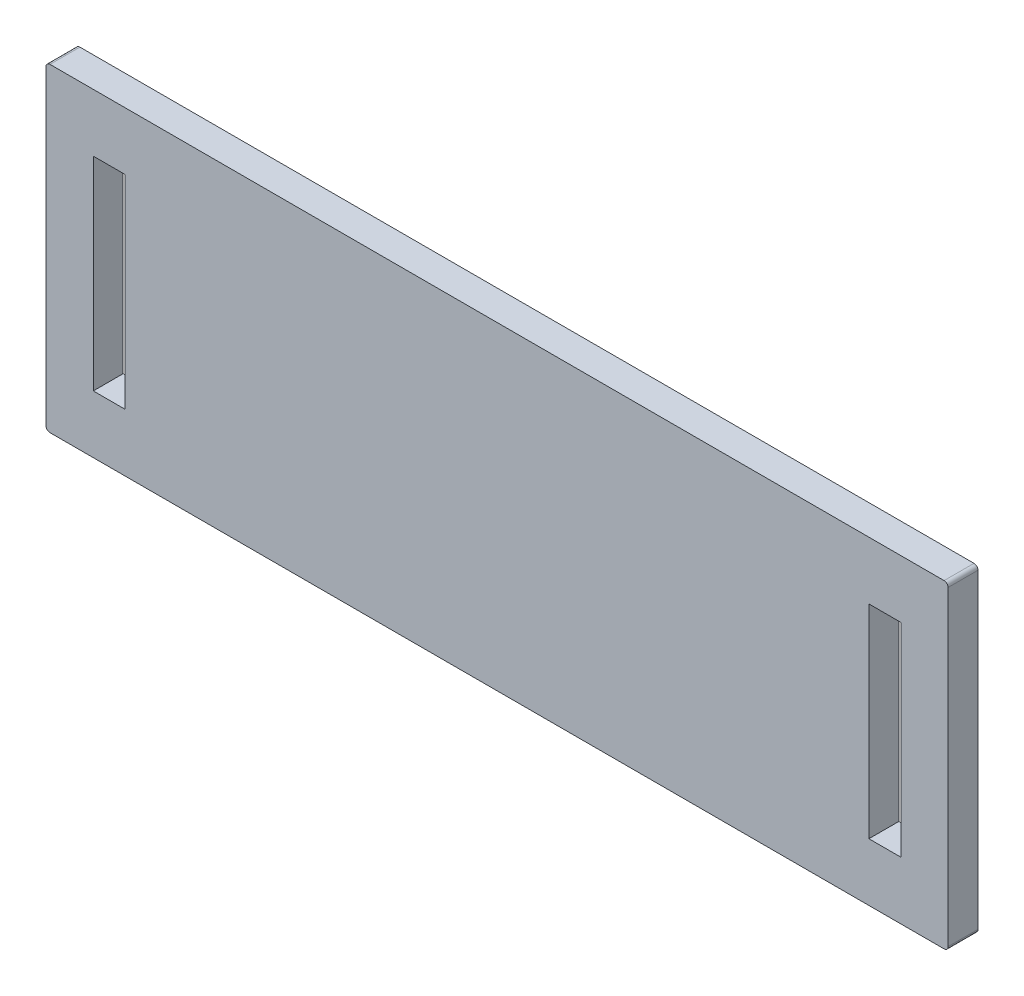
ISO-10303-21;
HEADER;
FILE_DESCRIPTION(('STEP AP214'),'2;1');
FILE_NAME('part.step','',(''),(''),'','','');
FILE_SCHEMA(('AUTOMOTIVE_DESIGN { 1 0 10303 214 1 1 1 1 }'));
ENDSEC;
DATA;
#1=APPLICATION_CONTEXT('core data for automotive mechanical design processes');
#2=APPLICATION_PROTOCOL_DEFINITION('international standard','automotive_design',2000,#1);
#3=PRODUCT_CONTEXT('',#1,'mechanical');
#4=PRODUCT('Part','Part','',(#3));
#5=PRODUCT_RELATED_PRODUCT_CATEGORY('part','',(#4));
#6=PRODUCT_DEFINITION_FORMATION('','',#4);
#7=PRODUCT_DEFINITION_CONTEXT('part definition',#1,'design');
#8=PRODUCT_DEFINITION('design','',#6,#7);
#9=PRODUCT_DEFINITION_SHAPE('','',#8);
#10=(LENGTH_UNIT() NAMED_UNIT(*) SI_UNIT(.MILLI.,.METRE.));
#11=(NAMED_UNIT(*) PLANE_ANGLE_UNIT() SI_UNIT($,.RADIAN.));
#12=(NAMED_UNIT(*) SI_UNIT($,.STERADIAN.) SOLID_ANGLE_UNIT());
#13=UNCERTAINTY_MEASURE_WITH_UNIT(LENGTH_MEASURE(1.E-05),#10,'distance_accuracy_value','');
#14=(GEOMETRIC_REPRESENTATION_CONTEXT(3) GLOBAL_UNCERTAINTY_ASSIGNED_CONTEXT((#13)) GLOBAL_UNIT_ASSIGNED_CONTEXT((#10,
#11,#12)) REPRESENTATION_CONTEXT('',''));
#15=CARTESIAN_POINT('',(0.,0.,0.));
#16=DIRECTION('',(0.,0.,1.));
#17=DIRECTION('',(1.,0.,0.));
#18=AXIS2_PLACEMENT_3D('',#15,#16,#17);
#19=CARTESIAN_POINT('',(45.05,15.8,-1.5));
#20=DIRECTION('',(0.,0.,1.));
#21=DIRECTION('',(1.,0.,0.));
#22=AXIS2_PLACEMENT_3D('',#19,#20,#21);
#23=CYLINDRICAL_SURFACE('',#22,0.199999999999997);
#24=CARTESIAN_POINT('',(45.05,15.8,0.));
#25=DIRECTION('',(0.,0.,1.));
#26=DIRECTION('',(-1.,0.,0.));
#27=AXIS2_PLACEMENT_3D('',#24,#25,#26);
#28=CIRCLE('',#27,0.199999999999997);
#29=CARTESIAN_POINT('',(45.25,15.8,0.));
#30=VERTEX_POINT('',#29);
#31=CARTESIAN_POINT('',(45.05,16.,0.));
#32=VERTEX_POINT('',#31);
#33=EDGE_CURVE('E256',#30,#32,#28,.T.);
#34=ORIENTED_EDGE('',*,*,#33,.F.);
#35=DIRECTION('',(0.,0.,1.));
#36=VECTOR('',#35,1.);
#37=CARTESIAN_POINT('',(45.25,15.8,-1.5));
#38=LINE('',#37,#36);
#39=CARTESIAN_POINT('',(45.25,15.8,-1.5));
#40=VERTEX_POINT('',#39);
#41=EDGE_CURVE('E12',#40,#30,#38,.T.);
#42=ORIENTED_EDGE('',*,*,#41,.F.);
#43=CARTESIAN_POINT('',(45.05,15.8,-1.5));
#44=DIRECTION('',(0.,0.,1.));
#45=DIRECTION('',(-1.,0.,0.));
#46=AXIS2_PLACEMENT_3D('',#43,#44,#45);
#47=CIRCLE('',#46,0.199999999999997);
#48=CARTESIAN_POINT('',(45.05,16.,-1.5));
#49=VERTEX_POINT('',#48);
#50=EDGE_CURVE('E266',#40,#49,#47,.T.);
#51=ORIENTED_EDGE('',*,*,#50,.T.);
#52=DIRECTION('',(0.,0.,1.));
#53=VECTOR('',#52,1.);
#54=CARTESIAN_POINT('',(45.05,16.,-1.5));
#55=LINE('',#54,#53);
#56=EDGE_CURVE('E46',#49,#32,#55,.T.);
#57=ORIENTED_EDGE('',*,*,#56,.T.);
#58=EDGE_LOOP('',(#34,#42,#51,#57));
#59=FACE_BOUND('',#58,.T.);
#60=ADVANCED_FACE('F43',(#59),#23,.T.);
#61=CARTESIAN_POINT('',(45.25,0.199999999999999,-1.5));
#62=DIRECTION('',(1.,0.,0.));
#63=DIRECTION('',(0.,0.,-1.));
#64=AXIS2_PLACEMENT_3D('',#61,#62,#63);
#65=PLANE('',#64);
#66=DIRECTION('',(0.,1.,0.));
#67=VECTOR('',#66,1.);
#68=CARTESIAN_POINT('',(45.25,0.199999999999999,0.));
#69=LINE('',#68,#67);
#70=CARTESIAN_POINT('',(45.25,0.199999999999999,0.));
#71=VERTEX_POINT('',#70);
#72=EDGE_CURVE('E271',#71,#30,#69,.T.);
#73=ORIENTED_EDGE('',*,*,#72,.F.);
#74=DIRECTION('',(0.,0.,1.));
#75=VECTOR('',#74,1.);
#76=CARTESIAN_POINT('',(45.25,0.199999999999999,-1.5));
#77=LINE('',#76,#75);
#78=CARTESIAN_POINT('',(45.25,0.199999999999999,-1.5));
#79=VERTEX_POINT('',#78);
#80=EDGE_CURVE('E52',#79,#71,#77,.T.);
#81=ORIENTED_EDGE('',*,*,#80,.F.);
#82=DIRECTION('',(0.,1.,0.));
#83=VECTOR('',#82,1.);
#84=CARTESIAN_POINT('',(45.25,0.199999999999999,-1.5));
#85=LINE('',#84,#83);
#86=EDGE_CURVE('E279',#79,#40,#85,.T.);
#87=ORIENTED_EDGE('',*,*,#86,.T.);
#88=ORIENTED_EDGE('',*,*,#41,.T.);
#89=EDGE_LOOP('',(#73,#81,#87,#88));
#90=FACE_BOUND('',#89,.T.);
#91=ADVANCED_FACE('F347',(#90),#65,.T.);
#92=CARTESIAN_POINT('',(45.05,0.199999999999999,-1.5));
#93=DIRECTION('',(0.,0.,1.));
#94=DIRECTION('',(1.,0.,0.));
#95=AXIS2_PLACEMENT_3D('',#92,#93,#94);
#96=CYLINDRICAL_SURFACE('',#95,0.199999999999997);
#97=CARTESIAN_POINT('',(45.05,0.199999999999999,0.));
#98=DIRECTION('',(0.,0.,1.));
#99=DIRECTION('',(1.,0.,0.));
#100=AXIS2_PLACEMENT_3D('',#97,#98,#99);
#101=CIRCLE('',#100,0.199999999999997);
#102=CARTESIAN_POINT('',(45.05,0.,0.));
#103=VERTEX_POINT('',#102);
#104=EDGE_CURVE('E309',#103,#71,#101,.T.);
#105=ORIENTED_EDGE('',*,*,#104,.F.);
#106=DIRECTION('',(0.,0.,1.));
#107=VECTOR('',#106,1.);
#108=CARTESIAN_POINT('',(45.05,0.,-1.5));
#109=LINE('',#108,#107);
#110=CARTESIAN_POINT('',(45.05,0.,-1.5));
#111=VERTEX_POINT('',#110);
#112=EDGE_CURVE('E318',#111,#103,#109,.T.);
#113=ORIENTED_EDGE('',*,*,#112,.F.);
#114=CARTESIAN_POINT('',(45.05,0.199999999999999,-1.5));
#115=DIRECTION('',(0.,0.,1.));
#116=DIRECTION('',(1.,0.,0.));
#117=AXIS2_PLACEMENT_3D('',#114,#115,#116);
#118=CIRCLE('',#117,0.199999999999997);
#119=EDGE_CURVE('E284',#111,#79,#118,.T.);
#120=ORIENTED_EDGE('',*,*,#119,.T.);
#121=ORIENTED_EDGE('',*,*,#80,.T.);
#122=EDGE_LOOP('',(#105,#113,#120,#121));
#123=FACE_BOUND('',#122,.T.);
#124=ADVANCED_FACE('F379',(#123),#96,.T.);
#125=CARTESIAN_POINT('',(0.200000000000001,0.,-1.5));
#126=DIRECTION('',(0.,-1.,0.));
#127=DIRECTION('',(1.,0.,0.));
#128=AXIS2_PLACEMENT_3D('',#125,#126,#127);
#129=PLANE('',#128);
#130=DIRECTION('',(1.,0.,0.));
#131=VECTOR('',#130,1.);
#132=CARTESIAN_POINT('',(0.200000000000001,0.,0.));
#133=LINE('',#132,#131);
#134=CARTESIAN_POINT('',(0.200000000000001,0.,0.));
#135=VERTEX_POINT('',#134);
#136=EDGE_CURVE('E305',#135,#103,#133,.T.);
#137=ORIENTED_EDGE('',*,*,#136,.F.);
#138=DIRECTION('',(0.,0.,1.));
#139=VECTOR('',#138,1.);
#140=CARTESIAN_POINT('',(0.200000000000001,0.,-1.5));
#141=LINE('',#140,#139);
#142=CARTESIAN_POINT('',(0.200000000000001,0.,-1.5));
#143=VERTEX_POINT('',#142);
#144=EDGE_CURVE('E321',#143,#135,#141,.T.);
#145=ORIENTED_EDGE('',*,*,#144,.F.);
#146=DIRECTION('',(1.,0.,0.));
#147=VECTOR('',#146,1.);
#148=CARTESIAN_POINT('',(0.200000000000001,0.,-1.5));
#149=LINE('',#148,#147);
#150=EDGE_CURVE('E371',#143,#111,#149,.T.);
#151=ORIENTED_EDGE('',*,*,#150,.T.);
#152=ORIENTED_EDGE('',*,*,#112,.T.);
#153=EDGE_LOOP('',(#137,#145,#151,#152));
#154=FACE_BOUND('',#153,.T.);
#155=ADVANCED_FACE('F389',(#154),#129,.T.);
#156=CARTESIAN_POINT('',(0.2,0.2,-1.5));
#157=DIRECTION('',(0.,0.,1.));
#158=DIRECTION('',(1.,0.,0.));
#159=AXIS2_PLACEMENT_3D('',#156,#157,#158);
#160=CYLINDRICAL_SURFACE('',#159,0.2);
#161=CARTESIAN_POINT('',(0.2,0.2,0.));
#162=DIRECTION('',(0.,0.,1.));
#163=DIRECTION('',(-1.,0.,0.));
#164=AXIS2_PLACEMENT_3D('',#161,#162,#163);
#165=CIRCLE('',#164,0.2);
#166=CARTESIAN_POINT('',(0.,0.200000000000001,0.));
#167=VERTEX_POINT('',#166);
#168=EDGE_CURVE('E301',#167,#135,#165,.T.);
#169=ORIENTED_EDGE('',*,*,#168,.F.);
#170=DIRECTION('',(0.,0.,1.));
#171=VECTOR('',#170,1.);
#172=CARTESIAN_POINT('',(0.,0.200000000000001,-1.5));
#173=LINE('',#172,#171);
#174=CARTESIAN_POINT('',(0.,0.200000000000001,-1.5));
#175=VERTEX_POINT('',#174);
#176=EDGE_CURVE('E324',#175,#167,#173,.T.);
#177=ORIENTED_EDGE('',*,*,#176,.F.);
#178=CARTESIAN_POINT('',(0.2,0.2,-1.5));
#179=DIRECTION('',(0.,0.,1.));
#180=DIRECTION('',(-1.,0.,0.));
#181=AXIS2_PLACEMENT_3D('',#178,#179,#180);
#182=CIRCLE('',#181,0.2);
#183=EDGE_CURVE('E361',#175,#143,#182,.T.);
#184=ORIENTED_EDGE('',*,*,#183,.T.);
#185=ORIENTED_EDGE('',*,*,#144,.T.);
#186=EDGE_LOOP('',(#169,#177,#184,#185));
#187=FACE_BOUND('',#186,.T.);
#188=ADVANCED_FACE('F383',(#187),#160,.T.);
#189=CARTESIAN_POINT('',(0.,0.200000000000001,-1.5));
#190=DIRECTION('',(-1.,0.,0.));
#191=DIRECTION('',(0.,-1.,0.));
#192=AXIS2_PLACEMENT_3D('',#189,#190,#191);
#193=PLANE('',#192);
#194=DIRECTION('',(0.,-1.,0.));
#195=VECTOR('',#194,1.);
#196=CARTESIAN_POINT('',(0.,0.200000000000001,0.));
#197=LINE('',#196,#195);
#198=CARTESIAN_POINT('',(0.,15.8,0.));
#199=VERTEX_POINT('',#198);
#200=EDGE_CURVE('E297',#199,#167,#197,.T.);
#201=ORIENTED_EDGE('',*,*,#200,.F.);
#202=DIRECTION('',(0.,0.,1.));
#203=VECTOR('',#202,1.);
#204=CARTESIAN_POINT('',(0.,15.8,-1.5));
#205=LINE('',#204,#203);
#206=CARTESIAN_POINT('',(0.,15.8,-1.5));
#207=VERTEX_POINT('',#206);
#208=EDGE_CURVE('E327',#207,#199,#205,.T.);
#209=ORIENTED_EDGE('',*,*,#208,.F.);
#210=DIRECTION('',(0.,-1.,0.));
#211=VECTOR('',#210,1.);
#212=CARTESIAN_POINT('',(0.,0.200000000000001,-1.5));
#213=LINE('',#212,#211);
#214=EDGE_CURVE('E357',#207,#175,#213,.T.);
#215=ORIENTED_EDGE('',*,*,#214,.T.);
#216=ORIENTED_EDGE('',*,*,#176,.T.);
#217=EDGE_LOOP('',(#201,#209,#215,#216));
#218=FACE_BOUND('',#217,.T.);
#219=ADVANCED_FACE('F387',(#218),#193,.T.);
#220=CARTESIAN_POINT('',(0.199999999999999,15.8,-1.5));
#221=DIRECTION('',(0.,0.,1.));
#222=DIRECTION('',(1.,0.,0.));
#223=AXIS2_PLACEMENT_3D('',#220,#221,#222);
#224=CYLINDRICAL_SURFACE('',#223,0.200000000000001);
#225=CARTESIAN_POINT('',(0.199999999999999,15.8,0.));
#226=DIRECTION('',(0.,0.,1.));
#227=DIRECTION('',(-1.,0.,0.));
#228=AXIS2_PLACEMENT_3D('',#225,#226,#227);
#229=CIRCLE('',#228,0.200000000000001);
#230=CARTESIAN_POINT('',(0.199999999999999,16.,0.));
#231=VERTEX_POINT('',#230);
#232=EDGE_CURVE('E293',#231,#199,#229,.T.);
#233=ORIENTED_EDGE('',*,*,#232,.F.);
#234=DIRECTION('',(0.,0.,1.));
#235=VECTOR('',#234,1.);
#236=CARTESIAN_POINT('',(0.199999999999999,16.,-1.5));
#237=LINE('',#236,#235);
#238=CARTESIAN_POINT('',(0.199999999999999,16.,-1.5));
#239=VERTEX_POINT('',#238);
#240=EDGE_CURVE('E329',#239,#231,#237,.T.);
#241=ORIENTED_EDGE('',*,*,#240,.F.);
#242=CARTESIAN_POINT('',(0.199999999999999,15.8,-1.5));
#243=DIRECTION('',(0.,0.,1.));
#244=DIRECTION('',(-1.,0.,0.));
#245=AXIS2_PLACEMENT_3D('',#242,#243,#244);
#246=CIRCLE('',#245,0.200000000000001);
#247=EDGE_CURVE('E355',#239,#207,#246,.T.);
#248=ORIENTED_EDGE('',*,*,#247,.T.);
#249=ORIENTED_EDGE('',*,*,#208,.T.);
#250=EDGE_LOOP('',(#233,#241,#248,#249));
#251=FACE_BOUND('',#250,.T.);
#252=ADVANCED_FACE('F388',(#251),#224,.T.);
#253=CARTESIAN_POINT('',(0.199999999999999,16.,-1.5));
#254=DIRECTION('',(0.,1.,0.));
#255=DIRECTION('',(-1.,0.,0.));
#256=AXIS2_PLACEMENT_3D('',#253,#254,#255);
#257=PLANE('',#256);
#258=DIRECTION('',(-1.,0.,0.));
#259=VECTOR('',#258,1.);
#260=CARTESIAN_POINT('',(0.199999999999999,16.,0.));
#261=LINE('',#260,#259);
#262=EDGE_CURVE('E290',#32,#231,#261,.T.);
#263=ORIENTED_EDGE('',*,*,#262,.F.);
#264=ORIENTED_EDGE('',*,*,#56,.F.);
#265=DIRECTION('',(-1.,0.,0.));
#266=VECTOR('',#265,1.);
#267=CARTESIAN_POINT('',(0.199999999999999,16.,-1.5));
#268=LINE('',#267,#266);
#269=EDGE_CURVE('E270',#49,#239,#268,.T.);
#270=ORIENTED_EDGE('',*,*,#269,.T.);
#271=ORIENTED_EDGE('',*,*,#240,.T.);
#272=EDGE_LOOP('',(#263,#264,#270,#271));
#273=FACE_BOUND('',#272,.T.);
#274=ADVANCED_FACE('F341',(#273),#257,.T.);
#275=CARTESIAN_POINT('',(45.05,15.8,-1.5));
#276=DIRECTION('',(0.,0.,-1.));
#277=DIRECTION('',(-1.,0.,0.));
#278=AXIS2_PLACEMENT_3D('',#275,#276,#277);
#279=PLANE('',#278);
#280=DIRECTION('',(-1.,0.,0.));
#281=VECTOR('',#280,1.);
#282=CARTESIAN_POINT('',(42.8779069767442,13.1,-1.5));
#283=LINE('',#282,#281);
#284=CARTESIAN_POINT('',(42.8779069767442,13.1,-1.5));
#285=VERTEX_POINT('',#284);
#286=CARTESIAN_POINT('',(41.2779069767442,13.1,-1.5));
#287=VERTEX_POINT('',#286);
#288=EDGE_CURVE('E159',#285,#287,#283,.T.);
#289=ORIENTED_EDGE('',*,*,#288,.T.);
#290=DIRECTION('',(0.,-1.,0.));
#291=VECTOR('',#290,1.);
#292=CARTESIAN_POINT('',(41.2779069767442,13.1,-1.5));
#293=LINE('',#292,#291);
#294=CARTESIAN_POINT('',(41.2779069767442,2.9,-1.5));
#295=VERTEX_POINT('',#294);
#296=EDGE_CURVE('E169',#287,#295,#293,.T.);
#297=ORIENTED_EDGE('',*,*,#296,.T.);
#298=DIRECTION('',(1.,0.,0.));
#299=VECTOR('',#298,1.);
#300=CARTESIAN_POINT('',(42.8779069767442,2.9,-1.5));
#301=LINE('',#300,#299);
#302=CARTESIAN_POINT('',(42.8779069767442,2.9,-1.5));
#303=VERTEX_POINT('',#302);
#304=EDGE_CURVE('E60',#295,#303,#301,.T.);
#305=ORIENTED_EDGE('',*,*,#304,.T.);
#306=DIRECTION('',(0.,1.,0.));
#307=VECTOR('',#306,1.);
#308=CARTESIAN_POINT('',(42.8779069767442,13.1,-1.5));
#309=LINE('',#308,#307);
#310=EDGE_CURVE('E166',#303,#285,#309,.T.);
#311=ORIENTED_EDGE('',*,*,#310,.T.);
#312=EDGE_LOOP('',(#289,#297,#305,#311));
#313=FACE_BOUND('',#312,.T.);
#314=DIRECTION('',(0.,-1.,0.));
#315=VECTOR('',#314,1.);
#316=CARTESIAN_POINT('',(2.37209302325581,13.1,-1.5));
#317=LINE('',#316,#315);
#318=CARTESIAN_POINT('',(2.37209302325581,13.1,-1.5));
#319=VERTEX_POINT('',#318);
#320=CARTESIAN_POINT('',(2.37209302325581,2.9,-1.5));
#321=VERTEX_POINT('',#320);
#322=EDGE_CURVE('E216',#319,#321,#317,.T.);
#323=ORIENTED_EDGE('',*,*,#322,.T.);
#324=DIRECTION('',(1.,0.,0.));
#325=VECTOR('',#324,1.);
#326=CARTESIAN_POINT('',(2.37209302325581,2.9,-1.5));
#327=LINE('',#326,#325);
#328=CARTESIAN_POINT('',(3.9720930232558,2.9,-1.5));
#329=VERTEX_POINT('',#328);
#330=EDGE_CURVE('E221',#321,#329,#327,.T.);
#331=ORIENTED_EDGE('',*,*,#330,.T.);
#332=DIRECTION('',(0.,1.,0.));
#333=VECTOR('',#332,1.);
#334=CARTESIAN_POINT('',(3.97209302325581,13.1,-1.5));
#335=LINE('',#334,#333);
#336=CARTESIAN_POINT('',(3.97209302325581,13.1,-1.5));
#337=VERTEX_POINT('',#336);
#338=EDGE_CURVE('E230',#329,#337,#335,.T.);
#339=ORIENTED_EDGE('',*,*,#338,.T.);
#340=DIRECTION('',(-1.,0.,0.));
#341=VECTOR('',#340,1.);
#342=CARTESIAN_POINT('',(2.37209302325581,13.1,-1.5));
#343=LINE('',#342,#341);
#344=EDGE_CURVE('E234',#337,#319,#343,.T.);
#345=ORIENTED_EDGE('',*,*,#344,.T.);
#346=EDGE_LOOP('',(#323,#331,#339,#345));
#347=FACE_BOUND('',#346,.T.);
#348=ORIENTED_EDGE('',*,*,#50,.F.);
#349=ORIENTED_EDGE('',*,*,#86,.F.);
#350=ORIENTED_EDGE('',*,*,#119,.F.);
#351=ORIENTED_EDGE('',*,*,#150,.F.);
#352=ORIENTED_EDGE('',*,*,#183,.F.);
#353=ORIENTED_EDGE('',*,*,#214,.F.);
#354=ORIENTED_EDGE('',*,*,#247,.F.);
#355=ORIENTED_EDGE('',*,*,#269,.F.);
#356=EDGE_LOOP('',(#348,#349,#350,#351,#352,#353,#354,#355));
#357=FACE_BOUND('',#356,.T.);
#358=ADVANCED_FACE('F174',(#313,#347,#357),#279,.T.);
#359=CARTESIAN_POINT('',(45.05,15.8,0.));
#360=DIRECTION('',(0.,0.,-1.));
#361=DIRECTION('',(-1.,0.,0.));
#362=AXIS2_PLACEMENT_3D('',#359,#360,#361);
#363=PLANE('',#362);
#364=DIRECTION('',(0.,-1.,0.));
#365=VECTOR('',#364,1.);
#366=CARTESIAN_POINT('',(41.2779069767442,13.1,0.));
#367=LINE('',#366,#365);
#368=CARTESIAN_POINT('',(41.2779069767442,13.1,0.));
#369=VERTEX_POINT('',#368);
#370=CARTESIAN_POINT('',(41.2779069767442,2.9,0.));
#371=VERTEX_POINT('',#370);
#372=EDGE_CURVE('E201',#369,#371,#367,.T.);
#373=ORIENTED_EDGE('',*,*,#372,.F.);
#374=DIRECTION('',(-1.,0.,0.));
#375=VECTOR('',#374,1.);
#376=CARTESIAN_POINT('',(42.8779069767442,13.1,0.));
#377=LINE('',#376,#375);
#378=CARTESIAN_POINT('',(42.8779069767442,13.1,0.));
#379=VERTEX_POINT('',#378);
#380=EDGE_CURVE('E68',#379,#369,#377,.T.);
#381=ORIENTED_EDGE('',*,*,#380,.F.);
#382=DIRECTION('',(0.,1.,0.));
#383=VECTOR('',#382,1.);
#384=CARTESIAN_POINT('',(42.8779069767442,13.1,0.));
#385=LINE('',#384,#383);
#386=CARTESIAN_POINT('',(42.8779069767442,2.9,0.));
#387=VERTEX_POINT('',#386);
#388=EDGE_CURVE('E178',#387,#379,#385,.T.);
#389=ORIENTED_EDGE('',*,*,#388,.F.);
#390=DIRECTION('',(1.,0.,0.));
#391=VECTOR('',#390,1.);
#392=CARTESIAN_POINT('',(42.8779069767442,2.9,0.));
#393=LINE('',#392,#391);
#394=EDGE_CURVE('E184',#371,#387,#393,.T.);
#395=ORIENTED_EDGE('',*,*,#394,.F.);
#396=EDGE_LOOP('',(#373,#381,#389,#395));
#397=FACE_BOUND('',#396,.T.);
#398=DIRECTION('',(1.,0.,0.));
#399=VECTOR('',#398,1.);
#400=CARTESIAN_POINT('',(2.37209302325581,2.9,0.));
#401=LINE('',#400,#399);
#402=CARTESIAN_POINT('',(2.37209302325581,2.9,0.));
#403=VERTEX_POINT('',#402);
#404=CARTESIAN_POINT('',(3.97209302325581,2.9,0.));
#405=VERTEX_POINT('',#404);
#406=EDGE_CURVE('E242',#403,#405,#401,.T.);
#407=ORIENTED_EDGE('',*,*,#406,.F.);
#408=DIRECTION('',(0.,-1.,0.));
#409=VECTOR('',#408,1.);
#410=CARTESIAN_POINT('',(2.37209302325581,13.1,0.));
#411=LINE('',#410,#409);
#412=CARTESIAN_POINT('',(2.37209302325581,13.1,0.));
#413=VERTEX_POINT('',#412);
#414=EDGE_CURVE('E210',#413,#403,#411,.T.);
#415=ORIENTED_EDGE('',*,*,#414,.F.);
#416=DIRECTION('',(-1.,0.,0.));
#417=VECTOR('',#416,1.);
#418=CARTESIAN_POINT('',(2.37209302325581,13.1,0.));
#419=LINE('',#418,#417);
#420=CARTESIAN_POINT('',(3.97209302325581,13.1,0.));
#421=VERTEX_POINT('',#420);
#422=EDGE_CURVE('E222',#421,#413,#419,.T.);
#423=ORIENTED_EDGE('',*,*,#422,.F.);
#424=DIRECTION('',(0.,1.,0.));
#425=VECTOR('',#424,1.);
#426=CARTESIAN_POINT('',(3.97209302325581,13.1,0.));
#427=LINE('',#426,#425);
#428=EDGE_CURVE('E246',#405,#421,#427,.T.);
#429=ORIENTED_EDGE('',*,*,#428,.F.);
#430=EDGE_LOOP('',(#407,#415,#423,#429));
#431=FACE_BOUND('',#430,.T.);
#432=ORIENTED_EDGE('',*,*,#33,.T.);
#433=ORIENTED_EDGE('',*,*,#262,.T.);
#434=ORIENTED_EDGE('',*,*,#232,.T.);
#435=ORIENTED_EDGE('',*,*,#200,.T.);
#436=ORIENTED_EDGE('',*,*,#168,.T.);
#437=ORIENTED_EDGE('',*,*,#136,.T.);
#438=ORIENTED_EDGE('',*,*,#104,.T.);
#439=ORIENTED_EDGE('',*,*,#72,.T.);
#440=EDGE_LOOP('',(#432,#433,#434,#435,#436,#437,#438,#439));
#441=FACE_BOUND('',#440,.T.);
#442=ADVANCED_FACE('F343',(#397,#431,#441),#363,.F.);
#443=CARTESIAN_POINT('',(2.37209302325581,13.1,-1.5));
#444=DIRECTION('',(-1.,0.,0.));
#445=DIRECTION('',(0.,0.,1.));
#446=AXIS2_PLACEMENT_3D('',#443,#444,#445);
#447=PLANE('',#446);
#448=ORIENTED_EDGE('',*,*,#414,.T.);
#449=DIRECTION('',(0.,0.,1.));
#450=VECTOR('',#449,1.);
#451=CARTESIAN_POINT('',(2.37209302325581,2.9,-1.5));
#452=LINE('',#451,#450);
#453=EDGE_CURVE('E239',#321,#403,#452,.T.);
#454=ORIENTED_EDGE('',*,*,#453,.F.);
#455=ORIENTED_EDGE('',*,*,#322,.F.);
#456=DIRECTION('',(0.,0.,1.));
#457=VECTOR('',#456,1.);
#458=CARTESIAN_POINT('',(2.37209302325581,13.1,-1.5));
#459=LINE('',#458,#457);
#460=EDGE_CURVE('E253',#319,#413,#459,.T.);
#461=ORIENTED_EDGE('',*,*,#460,.T.);
#462=EDGE_LOOP('',(#448,#454,#455,#461));
#463=FACE_BOUND('',#462,.T.);
#464=ADVANCED_FACE('F408',(#463),#447,.F.);
#465=CARTESIAN_POINT('',(2.37209302325581,13.1,-1.5));
#466=DIRECTION('',(0.,1.,0.));
#467=DIRECTION('',(0.,0.,1.));
#468=AXIS2_PLACEMENT_3D('',#465,#466,#467);
#469=PLANE('',#468);
#470=ORIENTED_EDGE('',*,*,#422,.T.);
#471=ORIENTED_EDGE('',*,*,#460,.F.);
#472=ORIENTED_EDGE('',*,*,#344,.F.);
#473=DIRECTION('',(0.,0.,1.));
#474=VECTOR('',#473,1.);
#475=CARTESIAN_POINT('',(3.97209302325581,13.1,-1.5));
#476=LINE('',#475,#474);
#477=EDGE_CURVE('E257',#337,#421,#476,.T.);
#478=ORIENTED_EDGE('',*,*,#477,.T.);
#479=EDGE_LOOP('',(#470,#471,#472,#478));
#480=FACE_BOUND('',#479,.T.);
#481=ADVANCED_FACE('F414',(#480),#469,.F.);
#482=CARTESIAN_POINT('',(3.97209302325581,13.1,-1.5));
#483=DIRECTION('',(1.,0.,0.));
#484=DIRECTION('',(0.,0.,-1.));
#485=AXIS2_PLACEMENT_3D('',#482,#483,#484);
#486=PLANE('',#485);
#487=ORIENTED_EDGE('',*,*,#428,.T.);
#488=ORIENTED_EDGE('',*,*,#477,.F.);
#489=ORIENTED_EDGE('',*,*,#338,.F.);
#490=DIRECTION('',(0.,0.,1.));
#491=VECTOR('',#490,1.);
#492=CARTESIAN_POINT('',(3.97209302325581,2.9,-1.5));
#493=LINE('',#492,#491);
#494=EDGE_CURVE('E260',#329,#405,#493,.T.);
#495=ORIENTED_EDGE('',*,*,#494,.T.);
#496=EDGE_LOOP('',(#487,#488,#489,#495));
#497=FACE_BOUND('',#496,.T.);
#498=ADVANCED_FACE('F419',(#497),#486,.F.);
#499=CARTESIAN_POINT('',(2.37209302325581,2.9,-1.5));
#500=DIRECTION('',(0.,-1.,0.));
#501=DIRECTION('',(0.,0.,-1.));
#502=AXIS2_PLACEMENT_3D('',#499,#500,#501);
#503=PLANE('',#502);
#504=ORIENTED_EDGE('',*,*,#406,.T.);
#505=ORIENTED_EDGE('',*,*,#494,.F.);
#506=ORIENTED_EDGE('',*,*,#330,.F.);
#507=ORIENTED_EDGE('',*,*,#453,.T.);
#508=EDGE_LOOP('',(#504,#505,#506,#507));
#509=FACE_BOUND('',#508,.T.);
#510=ADVANCED_FACE('F416',(#509),#503,.F.);
#511=CARTESIAN_POINT('',(42.8779069767442,13.1,-1.5));
#512=DIRECTION('',(0.,1.,0.));
#513=DIRECTION('',(0.,0.,1.));
#514=AXIS2_PLACEMENT_3D('',#511,#512,#513);
#515=PLANE('',#514);
#516=ORIENTED_EDGE('',*,*,#380,.T.);
#517=DIRECTION('',(0.,0.,1.));
#518=VECTOR('',#517,1.);
#519=CARTESIAN_POINT('',(41.2779069767442,13.1,-1.5));
#520=LINE('',#519,#518);
#521=EDGE_CURVE('E155',#287,#369,#520,.T.);
#522=ORIENTED_EDGE('',*,*,#521,.F.);
#523=ORIENTED_EDGE('',*,*,#288,.F.);
#524=DIRECTION('',(0.,0.,1.));
#525=VECTOR('',#524,1.);
#526=CARTESIAN_POINT('',(42.8779069767442,13.1,-1.5));
#527=LINE('',#526,#525);
#528=EDGE_CURVE('E207',#285,#379,#527,.T.);
#529=ORIENTED_EDGE('',*,*,#528,.T.);
#530=EDGE_LOOP('',(#516,#522,#523,#529));
#531=FACE_BOUND('',#530,.T.);
#532=ADVANCED_FACE('F157',(#531),#515,.F.);
#533=CARTESIAN_POINT('',(42.8779069767442,13.1,-1.5));
#534=DIRECTION('',(1.,0.,0.));
#535=DIRECTION('',(0.,0.,-1.));
#536=AXIS2_PLACEMENT_3D('',#533,#534,#535);
#537=PLANE('',#536);
#538=ORIENTED_EDGE('',*,*,#388,.T.);
#539=ORIENTED_EDGE('',*,*,#528,.F.);
#540=ORIENTED_EDGE('',*,*,#310,.F.);
#541=DIRECTION('',(0.,0.,1.));
#542=VECTOR('',#541,1.);
#543=CARTESIAN_POINT('',(42.8779069767442,2.9,-1.5));
#544=LINE('',#543,#542);
#545=EDGE_CURVE('E211',#303,#387,#544,.T.);
#546=ORIENTED_EDGE('',*,*,#545,.T.);
#547=EDGE_LOOP('',(#538,#539,#540,#546));
#548=FACE_BOUND('',#547,.T.);
#549=ADVANCED_FACE('F429',(#548),#537,.F.);
#550=CARTESIAN_POINT('',(42.8779069767442,2.9,-1.5));
#551=DIRECTION('',(0.,-1.,0.));
#552=DIRECTION('',(0.,0.,-1.));
#553=AXIS2_PLACEMENT_3D('',#550,#551,#552);
#554=PLANE('',#553);
#555=ORIENTED_EDGE('',*,*,#394,.T.);
#556=ORIENTED_EDGE('',*,*,#545,.F.);
#557=ORIENTED_EDGE('',*,*,#304,.F.);
#558=DIRECTION('',(0.,0.,1.));
#559=VECTOR('',#558,1.);
#560=CARTESIAN_POINT('',(41.2779069767442,2.9,-1.5));
#561=LINE('',#560,#559);
#562=EDGE_CURVE('E165',#295,#371,#561,.T.);
#563=ORIENTED_EDGE('',*,*,#562,.T.);
#564=EDGE_LOOP('',(#555,#556,#557,#563));
#565=FACE_BOUND('',#564,.T.);
#566=ADVANCED_FACE('F432',(#565),#554,.F.);
#567=CARTESIAN_POINT('',(41.2779069767442,13.1,-1.5));
#568=DIRECTION('',(-1.,0.,0.));
#569=DIRECTION('',(0.,0.,1.));
#570=AXIS2_PLACEMENT_3D('',#567,#568,#569);
#571=PLANE('',#570);
#572=ORIENTED_EDGE('',*,*,#372,.T.);
#573=ORIENTED_EDGE('',*,*,#562,.F.);
#574=ORIENTED_EDGE('',*,*,#296,.F.);
#575=ORIENTED_EDGE('',*,*,#521,.T.);
#576=EDGE_LOOP('',(#572,#573,#574,#575));
#577=FACE_BOUND('',#576,.T.);
#578=ADVANCED_FACE('F170',(#577),#571,.F.);
#579=CLOSED_SHELL('',(#60,#91,#124,#155,#188,#219,#252,#274,#358,#442,#464,#481,#498,#510,#532,
#549,#566,#578));
#580=MANIFOLD_SOLID_BREP('B2',#579);
#581=ADVANCED_BREP_SHAPE_REPRESENTATION('',(#18,#580),#14);
#582=SHAPE_DEFINITION_REPRESENTATION(#9,#581);
ENDSEC;
END-ISO-10303-21;
